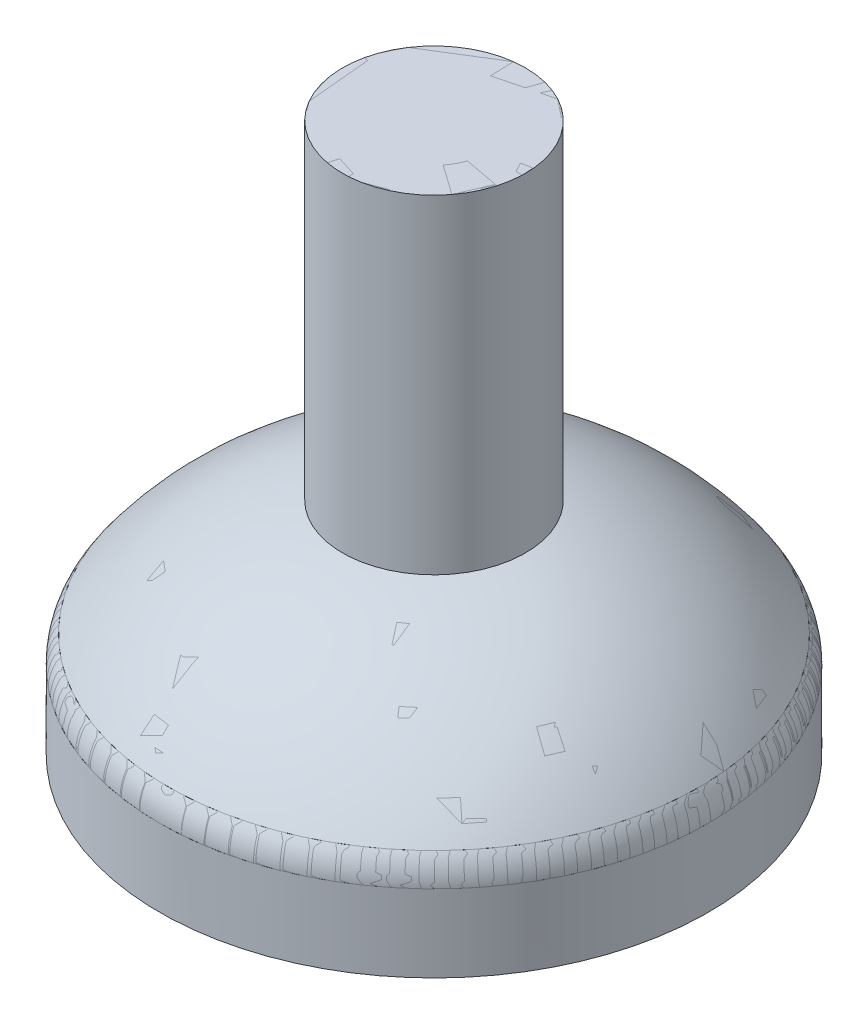
ISO-10303-21;
HEADER;
FILE_DESCRIPTION(('STEP AP214'),'2;1');
FILE_NAME('part.step','',(''),(''),'','','');
FILE_SCHEMA(('AUTOMOTIVE_DESIGN { 1 0 10303 214 1 1 1 1 }'));
ENDSEC;
DATA;
#1=APPLICATION_CONTEXT('core data for automotive mechanical design processes');
#2=APPLICATION_PROTOCOL_DEFINITION('international standard','automotive_design',2000,#1);
#3=PRODUCT_CONTEXT('',#1,'mechanical');
#4=PRODUCT('Part','Part','',(#3));
#5=PRODUCT_RELATED_PRODUCT_CATEGORY('part','',(#4));
#6=PRODUCT_DEFINITION_FORMATION('','',#4);
#7=PRODUCT_DEFINITION_CONTEXT('part definition',#1,'design');
#8=PRODUCT_DEFINITION('design','',#6,#7);
#9=PRODUCT_DEFINITION_SHAPE('','',#8);
#10=(LENGTH_UNIT() NAMED_UNIT(*) SI_UNIT(.MILLI.,.METRE.));
#11=(NAMED_UNIT(*) PLANE_ANGLE_UNIT() SI_UNIT($,.RADIAN.));
#12=(NAMED_UNIT(*) SI_UNIT($,.STERADIAN.) SOLID_ANGLE_UNIT());
#13=UNCERTAINTY_MEASURE_WITH_UNIT(LENGTH_MEASURE(1.E-05),#10,'distance_accuracy_value','');
#14=(GEOMETRIC_REPRESENTATION_CONTEXT(3) GLOBAL_UNCERTAINTY_ASSIGNED_CONTEXT((#13)) GLOBAL_UNIT_ASSIGNED_CONTEXT((#10,
#11,#12)) REPRESENTATION_CONTEXT('',''));
#15=CARTESIAN_POINT('',(0.,0.,0.));
#16=DIRECTION('',(0.,0.,1.));
#17=DIRECTION('',(1.,0.,0.));
#18=AXIS2_PLACEMENT_3D('',#15,#16,#17);
#19=CARTESIAN_POINT('',(-1.18800596857497E-13,50.,0.));
#20=DIRECTION('',(0.,-1.,0.));
#21=DIRECTION('',(1.,0.,0.));
#22=AXIS2_PLACEMENT_3D('',#19,#20,#21);
#23=PLANE('',#22);
#24=CARTESIAN_POINT('',(0.,50.,0.));
#25=DIRECTION('',(0.,-1.,0.));
#26=DIRECTION('',(1.,0.,0.));
#27=AXIS2_PLACEMENT_3D('',#24,#25,#26);
#28=CIRCLE('',#27,6.);
#29=CARTESIAN_POINT('',(6.,50.,0.));
#30=VERTEX_POINT('',#29);
#31=EDGE_CURVE('E13',#30,#30,#28,.F.);
#32=ORIENTED_EDGE('',*,*,#31,.T.);
#33=EDGE_LOOP('',(#32));
#34=FACE_BOUND('',#33,.T.);
#35=ADVANCED_FACE('F78',(#34),#23,.F.);
#36=OPEN_SHELL('',(#35));
#37=SHELL_BASED_SURFACE_MODEL('B2',(#36));
#38=CARTESIAN_POINT('',(0.,50.,0.));
#39=DIRECTION('',(0.,-1.,0.));
#40=DIRECTION('',(0.,0.,-1.));
#41=AXIS2_PLACEMENT_3D('',#38,#39,#40);
#42=PLANE('',#41);
#43=CARTESIAN_POINT('',(0.,50.,0.));
#44=DIRECTION('',(0.,-1.,0.));
#45=DIRECTION('',(0.,0.,-1.));
#46=AXIS2_PLACEMENT_3D('',#43,#44,#45);
#47=CIRCLE('',#46,10.);
#48=CARTESIAN_POINT('',(0.,50.,-10.));
#49=VERTEX_POINT('',#48);
#50=EDGE_CURVE('E77',#49,#49,#47,.T.);
#51=ORIENTED_EDGE('',*,*,#50,.F.);
#52=EDGE_LOOP('',(#51));
#53=FACE_BOUND('',#52,.T.);
#54=ADVANCED_FACE('F103',(#53),#42,.F.);
#55=OPEN_SHELL('',(#54));
#56=SHELL_BASED_SURFACE_MODEL('B8',(#55));
#57=CARTESIAN_POINT('',(0.644392351935432,-1.55929037654342,30.000000952671));
#58=DIRECTION('',(0.,-1.,0.));
#59=DIRECTION('',(-0.999999999998907,0.,-1.47840202791453E-06));
#60=AXIS2_PLACEMENT_3D('',#57,#58,#59);
#61=PLANE('',#60);
#62=CARTESIAN_POINT('',(0.,-1.55929037654342,30.));
#63=CARTESIAN_POINT('',(-0.644552371913862,-1.55929037654342,29.9999990470925));
#64=CARTESIAN_POINT('',(-3.16525432106434,-1.55929037654342,29.9202806916136));
#65=CARTESIAN_POINT('',(-8.26962113542297,-1.55929037654342,29.1125402238125));
#66=CARTESIAN_POINT('',(-16.1612420743914,-1.55929037654343,25.9215433021172));
#67=CARTESIAN_POINT('',(-23.436357526206,-1.55929037654342,19.6397738977112));
#68=CARTESIAN_POINT('',(-28.1437919198371,-1.55929037654343,11.4331736908759));
#69=CARTESIAN_POINT('',(-30.2566551255534,-1.55929037654343,3.05134129951869));
#70=CARTESIAN_POINT('',(-29.9503328345706,-1.55929037654342,-5.26449103840131));
#71=CARTESIAN_POINT('',(-27.0738834338733,-1.55929037654342,-13.9249991525626));
#72=CARTESIAN_POINT('',(-21.064689556289,-1.55929037654343,-22.3880854091475));
#73=CARTESIAN_POINT('',(-12.4162491087747,-1.55929037654342,-27.946398729217));
#74=CARTESIAN_POINT('',(-2.8193351851086,-1.55929037654343,-30.2478999684719));
#75=CARTESIAN_POINT('',(5.26450122217147,-1.55929037654343,-29.9503711705422));
#76=CARTESIAN_POINT('',(13.9249973641983,-1.55929037654342,-27.0738767017214));
#77=CARTESIAN_POINT('',(20.8459831056531,-1.55929037654342,-22.1596555580306));
#78=CARTESIAN_POINT('',(26.3503591142109,-1.55929037654342,-15.1161246635229));
#79=CARTESIAN_POINT('',(29.866128550795,-1.55929037654342,-6.54197230027541));
#80=CARTESIAN_POINT('',(30.353870436161,-1.55929037654342,2.74919510068262));
#81=CARTESIAN_POINT('',(27.9509479287229,-1.55929037654342,12.06740591218));
#82=CARTESIAN_POINT('',(22.8552900707096,-1.55929037654342,20.4034501179128));
#83=CARTESIAN_POINT('',(15.3128851703049,-1.55929037654342,26.3351601866233));
#84=CARTESIAN_POINT('',(7.90038592307573,-1.55929037654342,29.1708831651559));
#85=CARTESIAN_POINT('',(3.16473716708824,-1.55929037654342,29.9203001561334));
#86=CARTESIAN_POINT('',(0.644392351935432,-1.55929037654342,30.000000952671));
#87=CARTESIAN_POINT('',(0.,-1.55929037654342,30.));
#88=B_SPLINE_CURVE_WITH_KNOTS('',3,(#62,#63,#64,#65,#66,#67,#68,#69,#70,#71,#72,#73,#74,#75,#76,
#77,#78,#79,#80,#81,#82,#83,#84,#85,#86,#87),.UNSPECIFIED.,.T.,.F.,(4,1,1,1,1,1,1,1,1,1,1,1,1,1,
1,1,1,1,1,1,1,1,1,4),(0.,0.0102579911031687,0.0401157094266542,0.0818804187444345,
0.144562692401133,0.1902049550776,0.230919105134809,0.281005413815135,0.321028704089461,
0.374998336740974,0.443855714304826,0.480919105134809,0.531005413815135,0.571028704089461,
0.624998336740974,0.664181926764907,0.71224080695103,0.770793169980908,0.809798883491781,
0.864241702961095,0.924031285061479,0.959888038413167,0.989744555599918,1.),.UNSPECIFIED.);
#89=CARTESIAN_POINT('',(0.,-1.55929037654342,30.));
#90=VERTEX_POINT('',#89);
#91=EDGE_CURVE('E102',#90,#90,#88,.T.);
#92=ORIENTED_EDGE('',*,*,#91,.F.);
#93=EDGE_LOOP('',(#92));
#94=FACE_BOUND('',#93,.T.);
#95=CARTESIAN_POINT('',(2.95263956385676E-05,-1.55929037654342,9.99014801178763));
#96=CARTESIAN_POINT('',(-0.215051502689764,-1.55929037654343,9.99014762003898));
#97=CARTESIAN_POINT('',(-1.05546952946532,-1.55929037654343,9.98420524858686));
#98=CARTESIAN_POINT('',(-2.7585783411039,-1.55929037654342,9.7121560850228));
#99=CARTESIAN_POINT('',(-5.38594969823138,-1.55929037654343,8.63857531380397));
#100=CARTESIAN_POINT('',(-7.80942623489931,-1.55929037654342,6.54449866869036));
#101=CARTESIAN_POINT('',(-9.38428564382717,-1.55929037654343,3.81176937851403));
#102=CARTESIAN_POINT('',(-10.0883449477356,-1.55929037654343,1.01716937793569));
#103=CARTESIAN_POINT('',(-9.98592547867134,-1.55929037654342,-1.7549629900225));
#104=CARTESIAN_POINT('',(-9.025821004255,-1.55929037654342,-4.64178684207614));
#105=CARTESIAN_POINT('',(-7.01836773672822,-1.55929037654342,-7.45934313318599));
#106=CARTESIAN_POINT('',(-4.13912868661638,-1.55929037654342,-9.31731033884734));
#107=CARTESIAN_POINT('',(-0.93990237151419,-1.55929037654342,-10.0855263801625));
#108=CARTESIAN_POINT('',(1.75488713776625,-1.55929037654343,-9.98593042953104));
#109=CARTESIAN_POINT('',(4.64171581591682,-1.55929037654342,-9.02585914465808));
#110=CARTESIAN_POINT('',(6.94588391822176,-1.55929037654342,-7.38421053676711));
#111=CARTESIAN_POINT('',(8.78352199783138,-1.55929037654343,-5.03843830281855));
#112=CARTESIAN_POINT('',(9.95789788877089,-1.55929037654342,-2.18093423844639));
#113=CARTESIAN_POINT('',(10.1207374361067,-1.55929037654343,0.916345677603762));
#114=CARTESIAN_POINT('',(9.31972657213874,-1.55929037654343,4.02282561223756));
#115=CARTESIAN_POINT('',(7.61490460878052,-1.55929037654342,6.79769738799291));
#116=CARTESIAN_POINT('',(5.10408435353565,-1.55929037654342,8.77777176955977));
#117=CARTESIAN_POINT('',(2.63547568098967,-1.55929037654342,9.73119131024954));
#118=CARTESIAN_POINT('',(1.05539647256095,-1.55929037654342,9.98420467232548));
#119=CARTESIAN_POINT('',(0.215057158328011,-1.55929037654342,9.99014840343902));
#120=CARTESIAN_POINT('',(2.95263956385676E-05,-1.55929037654342,9.99014801178763));
#121=B_SPLINE_CURVE_WITH_KNOTS('',3,(#95,#96,#97,#98,#99,#100,#101,#102,#103,#104,#105,#106,
#107,#108,#109,#110,#111,#112,#113,#114,#115,#116,#117,#118,#119,#120),.UNSPECIFIED.,.T.,.F.,(4,
1,1,1,1,1,1,1,1,1,1,1,1,1,1,1,1,1,1,1,1,1,1,4),(0.,0.0102579911031687,0.0401157094266542,
0.0818804187444345,0.144562692401133,0.1902049550776,0.230919105134809,0.281005413815135,
0.321028704089461,0.374998336740974,0.443855714304826,0.480919105134809,0.531005413815135,
0.571028704089461,0.624998336740974,0.664181926764907,0.71224080695103,0.770793169980908,
0.809798883491781,0.864241702961095,0.924031285061479,0.959888038413167,0.989744555599918,1.),.UNSPECIFIED.);
#122=CARTESIAN_POINT('',(2.95263956385676E-05,-1.55929037654342,9.99014801178763));
#123=VERTEX_POINT('',#122);
#124=EDGE_CURVE('E129',#123,#123,#121,.F.);
#125=ORIENTED_EDGE('',*,*,#124,.F.);
#126=EDGE_LOOP('',(#125));
#127=FACE_BOUND('',#126,.T.);
#128=ADVANCED_FACE('F128',(#94,#127),#61,.F.);
#129=OPEN_SHELL('',(#128));
#130=SHELL_BASED_SURFACE_MODEL('B72',(#129));
#131=CARTESIAN_POINT('',(0.,1.39151240351967,0.));
#132=DIRECTION('',(0.,1.,0.));
#133=DIRECTION('',(0.,0.,1.));
#134=AXIS2_PLACEMENT_3D('',#131,#132,#133);
#135=PLANE('',#134);
#136=CARTESIAN_POINT('',(0.,1.39151240351967,0.));
#137=DIRECTION('',(0.,1.,0.));
#138=DIRECTION('',(0.,0.,1.));
#139=AXIS2_PLACEMENT_3D('',#136,#137,#138);
#140=CIRCLE('',#139,29.0364294807629);
#141=CARTESIAN_POINT('',(0.,1.39151240351967,29.0364294807629));
#142=VERTEX_POINT('',#141);
#143=EDGE_CURVE('E127',#142,#142,#140,.T.);
#144=ORIENTED_EDGE('',*,*,#143,.T.);
#145=EDGE_LOOP('',(#144));
#146=FACE_BOUND('',#145,.T.);
#147=ADVANCED_FACE('F171',(#146),#135,.T.);
#148=OPEN_SHELL('',(#147));
#149=SHELL_BASED_SURFACE_MODEL('B97',(#148));
#150=CARTESIAN_POINT('',(0.,9.17631656155722,0.));
#151=DIRECTION('',(0.,1.,0.));
#152=DIRECTION('',(0.,0.,1.));
#153=AXIS2_PLACEMENT_3D('',#150,#151,#152);
#154=PLANE('',#153);
#155=CARTESIAN_POINT('',(0.,9.17631656155722,0.));
#156=DIRECTION('',(0.,1.,0.));
#157=DIRECTION('',(0.,0.,1.));
#158=AXIS2_PLACEMENT_3D('',#155,#156,#157);
#159=CIRCLE('',#158,8.84343670463969);
#160=CARTESIAN_POINT('',(0.,9.17631656155722,8.84343670463969));
#161=VERTEX_POINT('',#160);
#162=EDGE_CURVE('E170',#161,#161,#159,.F.);
#163=ORIENTED_EDGE('',*,*,#162,.F.);
#164=EDGE_LOOP('',(#163));
#165=FACE_BOUND('',#164,.T.);
#166=ADVANCED_FACE('F196',(#165),#154,.T.);
#167=OPEN_SHELL('',(#166));
#168=SHELL_BASED_SURFACE_MODEL('B122',(#167));
#169=CARTESIAN_POINT('',(0.,-1.55929037654343,0.));
#170=DIRECTION('',(0.,1.,0.));
#171=DIRECTION('',(0.,0.,1.));
#172=AXIS2_PLACEMENT_3D('',#169,#170,#171);
#173=TOROIDAL_SURFACE('',#172,25.,5.);
#174=CARTESIAN_POINT('',(0.,1.39151240351967,0.));
#175=DIRECTION('',(0.,-1.,0.));
#176=DIRECTION('',(0.,0.,-1.));
#177=AXIS2_PLACEMENT_3D('',#174,#175,#176);
#178=CIRCLE('',#177,29.0364294807629);
#179=CARTESIAN_POINT('',(0.,1.39151240351967,-29.0364294807629));
#180=VERTEX_POINT('',#179);
#181=EDGE_CURVE('E224',#180,#180,#178,.F.);
#182=ORIENTED_EDGE('',*,*,#181,.F.);
#183=EDGE_LOOP('',(#182));
#184=FACE_BOUND('',#183,.T.);
#185=CARTESIAN_POINT('',(0.,-1.55929037654342,0.));
#186=DIRECTION('',(0.,1.,0.));
#187=DIRECTION('',(0.,0.,1.));
#188=AXIS2_PLACEMENT_3D('',#185,#186,#187);
#189=CIRCLE('',#188,30.);
#190=CARTESIAN_POINT('',(0.,-1.55929037654342,30.));
#191=VERTEX_POINT('',#190);
#192=EDGE_CURVE('E195',#191,#191,#189,.F.);
#193=ORIENTED_EDGE('',*,*,#192,.F.);
#194=EDGE_LOOP('',(#193));
#195=FACE_BOUND('',#194,.T.);
#196=ADVANCED_FACE('F220',(#184,#195),#173,.T.);
#197=OPEN_SHELL('',(#196));
#198=SHELL_BASED_SURFACE_MODEL('B165',(#197));
#199=CARTESIAN_POINT('',(0.,-18.1138206286321,0.));
#200=DIRECTION('',(0.,-1.,0.));
#201=DIRECTION('',(0.,0.,-1.));
#202=AXIS2_PLACEMENT_3D('',#199,#200,#201);
#203=DEGENERATE_TOROIDAL_SURFACE('',#202,2.35491019556269,33.0508923943312,.T.);
#204=CARTESIAN_POINT('',(0.,1.39151240351967,0.));
#205=DIRECTION('',(0.,-1.,0.));
#206=DIRECTION('',(0.,0.,-1.));
#207=AXIS2_PLACEMENT_3D('',#204,#205,#206);
#208=CIRCLE('',#207,29.0364294807629);
#209=CARTESIAN_POINT('',(0.,1.39151240351967,-29.0364294807629));
#210=VERTEX_POINT('',#209);
#211=EDGE_CURVE('E261',#210,#210,#208,.F.);
#212=ORIENTED_EDGE('',*,*,#211,.T.);
#213=EDGE_LOOP('',(#212));
#214=FACE_BOUND('',#213,.T.);
#215=CARTESIAN_POINT('',(0.,14.0407138874163,0.));
#216=DIRECTION('',(0.,-1.,0.));
#217=DIRECTION('',(0.,0.,-1.));
#218=AXIS2_PLACEMENT_3D('',#215,#216,#217);
#219=CIRCLE('',#218,10.);
#220=CARTESIAN_POINT('',(0.,14.0407138874163,-10.));
#221=VERTEX_POINT('',#220);
#222=EDGE_CURVE('E219',#221,#221,#219,.T.);
#223=ORIENTED_EDGE('',*,*,#222,.T.);
#224=EDGE_LOOP('',(#223));
#225=FACE_BOUND('',#224,.T.);
#226=ADVANCED_FACE('F257',(#214,#225),#203,.T.);
#227=OPEN_SHELL('',(#226));
#228=SHELL_BASED_SURFACE_MODEL('B190',(#227));
#229=CARTESIAN_POINT('',(0.,9.17631656155721,0.));
#230=DIRECTION('',(0.,1.,0.));
#231=DIRECTION('',(0.,0.,1.));
#232=AXIS2_PLACEMENT_3D('',#229,#230,#231);
#233=PLANE('',#232);
#234=CARTESIAN_POINT('',(0.,9.17631656155721,0.));
#235=DIRECTION('',(0.,1.,0.));
#236=DIRECTION('',(0.,0.,1.));
#237=AXIS2_PLACEMENT_3D('',#234,#235,#236);
#238=CIRCLE('',#237,6.);
#239=CARTESIAN_POINT('',(0.,9.17631656155721,6.));
#240=VERTEX_POINT('',#239);
#241=EDGE_CURVE('E330',#240,#240,#238,.F.);
#242=ORIENTED_EDGE('',*,*,#241,.F.);
#243=EDGE_LOOP('',(#242));
#244=FACE_BOUND('',#243,.T.);
#245=CARTESIAN_POINT('',(0.,9.17631656155721,0.));
#246=DIRECTION('',(0.,-1.,0.));
#247=DIRECTION('',(0.,0.,-1.));
#248=AXIS2_PLACEMENT_3D('',#245,#246,#247);
#249=CIRCLE('',#248,8.84343670463969);
#250=CARTESIAN_POINT('',(0.,9.17631656155721,-8.84343670463969));
#251=VERTEX_POINT('',#250);
#252=EDGE_CURVE('E303',#251,#251,#249,.T.);
#253=ORIENTED_EDGE('',*,*,#252,.T.);
#254=EDGE_LOOP('',(#253));
#255=FACE_BOUND('',#254,.T.);
#256=ADVANCED_FACE('F287',(#244,#255),#233,.F.);
#257=CARTESIAN_POINT('',(0.,-18.1138206286321,0.));
#258=DIRECTION('',(0.,-1.,0.));
#259=DIRECTION('',(0.,0.,-1.));
#260=AXIS2_PLACEMENT_3D('',#257,#258,#259);
#261=DEGENERATE_TOROIDAL_SURFACE('',#260,2.35491019556269,28.0508923943312,.T.);
#262=ORIENTED_EDGE('',*,*,#252,.F.);
#263=EDGE_LOOP('',(#262));
#264=FACE_BOUND('',#263,.T.);
#265=CARTESIAN_POINT('',(0.,-2.74029221548931,0.));
#266=DIRECTION('',(0.,-1.,0.));
#267=DIRECTION('',(0.,0.,-1.));
#268=AXIS2_PLACEMENT_3D('',#265,#266,#267);
#269=CIRCLE('',#268,25.8177997927253);
#270=CARTESIAN_POINT('',(0.,-2.74029221548931,-25.8177997927253));
#271=VERTEX_POINT('',#270);
#272=EDGE_CURVE('E310',#271,#271,#269,.T.);
#273=ORIENTED_EDGE('',*,*,#272,.T.);
#274=EDGE_LOOP('',(#273));
#275=FACE_BOUND('',#274,.T.);
#276=ADVANCED_FACE('F364',(#264,#275),#261,.F.);
#277=CARTESIAN_POINT('',(0.,14.0407138874163,0.));
#278=DIRECTION('',(0.,-1.,0.));
#279=DIRECTION('',(0.,0.,-1.));
#280=AXIS2_PLACEMENT_3D('',#277,#278,#279);
#281=CYLINDRICAL_SURFACE('',#280,25.8177997927253);
#282=ORIENTED_EDGE('',*,*,#272,.F.);
#283=EDGE_LOOP('',(#282));
#284=FACE_BOUND('',#283,.T.);
#285=CARTESIAN_POINT('',(0.,-9.99999999999999,0.));
#286=DIRECTION('',(0.,-1.,0.));
#287=DIRECTION('',(0.,0.,-1.));
#288=AXIS2_PLACEMENT_3D('',#285,#286,#287);
#289=CIRCLE('',#288,25.8177997927253);
#290=CARTESIAN_POINT('',(0.,-9.99999999999999,-25.8177997927253));
#291=VERTEX_POINT('',#290);
#292=EDGE_CURVE('E315',#291,#291,#289,.T.);
#293=ORIENTED_EDGE('',*,*,#292,.T.);
#294=EDGE_LOOP('',(#293));
#295=FACE_BOUND('',#294,.T.);
#296=ADVANCED_FACE('F370',(#284,#295),#281,.F.);
#297=CARTESIAN_POINT('',(-25.8177997927253,-9.99999999999999,0.));
#298=DIRECTION('',(0.,1.,0.));
#299=DIRECTION('',(0.,0.,1.));
#300=AXIS2_PLACEMENT_3D('',#297,#298,#299);
#301=PLANE('',#300);
#302=ORIENTED_EDGE('',*,*,#292,.F.);
#303=EDGE_LOOP('',(#302));
#304=FACE_BOUND('',#303,.T.);
#305=CARTESIAN_POINT('',(0.,-9.99999999999999,0.));
#306=DIRECTION('',(0.,-1.,0.));
#307=DIRECTION('',(0.,0.,-1.));
#308=AXIS2_PLACEMENT_3D('',#305,#306,#307);
#309=CIRCLE('',#308,30.);
#310=CARTESIAN_POINT('',(0.,-9.99999999999999,-30.));
#311=VERTEX_POINT('',#310);
#312=EDGE_CURVE('E319',#311,#311,#309,.T.);
#313=ORIENTED_EDGE('',*,*,#312,.T.);
#314=EDGE_LOOP('',(#313));
#315=FACE_BOUND('',#314,.T.);
#316=ADVANCED_FACE('F378',(#304,#315),#301,.F.);
#317=CARTESIAN_POINT('',(0.,14.0407138874163,0.));
#318=DIRECTION('',(0.,-1.,0.));
#319=DIRECTION('',(0.,0.,-1.));
#320=AXIS2_PLACEMENT_3D('',#317,#318,#319);
#321=CYLINDRICAL_SURFACE('',#320,30.);
#322=CARTESIAN_POINT('',(0.,-1.55929037654342,0.));
#323=DIRECTION('',(0.,1.,0.));
#324=DIRECTION('',(0.,0.,1.));
#325=AXIS2_PLACEMENT_3D('',#322,#323,#324);
#326=CIRCLE('',#325,30.);
#327=CARTESIAN_POINT('',(0.,-1.55929037654342,30.));
#328=VERTEX_POINT('',#327);
#329=EDGE_CURVE('E295',#328,#328,#326,.F.);
#330=ORIENTED_EDGE('',*,*,#329,.T.);
#331=EDGE_LOOP('',(#330));
#332=FACE_BOUND('',#331,.T.);
#333=ORIENTED_EDGE('',*,*,#312,.F.);
#334=EDGE_LOOP('',(#333));
#335=FACE_BOUND('',#334,.T.);
#336=ADVANCED_FACE('F360',(#332,#335),#321,.T.);
#337=CARTESIAN_POINT('',(0.,-18.1138206286321,0.));
#338=DIRECTION('',(0.,-1.,0.));
#339=DIRECTION('',(0.,0.,-1.));
#340=AXIS2_PLACEMENT_3D('',#337,#338,#339);
#341=DEGENERATE_TOROIDAL_SURFACE('',#340,2.35491019556269,33.0508923943312,.T.);
#342=CARTESIAN_POINT('',(0.,1.39151240351967,0.));
#343=DIRECTION('',(0.,-1.,0.));
#344=DIRECTION('',(0.,0.,-1.));
#345=AXIS2_PLACEMENT_3D('',#342,#343,#344);
#346=CIRCLE('',#345,29.0364294807629);
#347=CARTESIAN_POINT('',(0.,1.39151240351967,-29.0364294807629));
#348=VERTEX_POINT('',#347);
#349=EDGE_CURVE('E256',#348,#348,#346,.F.);
#350=ORIENTED_EDGE('',*,*,#349,.T.);
#351=EDGE_LOOP('',(#350));
#352=FACE_BOUND('',#351,.T.);
#353=CARTESIAN_POINT('',(0.,14.0407138874163,0.));
#354=DIRECTION('',(0.,-1.,0.));
#355=DIRECTION('',(0.,0.,-1.));
#356=AXIS2_PLACEMENT_3D('',#353,#354,#355);
#357=CIRCLE('',#356,10.);
#358=CARTESIAN_POINT('',(0.,14.0407138874163,-10.));
#359=VERTEX_POINT('',#358);
#360=EDGE_CURVE('E323',#359,#359,#357,.T.);
#361=ORIENTED_EDGE('',*,*,#360,.T.);
#362=EDGE_LOOP('',(#361));
#363=FACE_BOUND('',#362,.T.);
#364=ADVANCED_FACE('F352',(#352,#363),#341,.T.);
#365=CARTESIAN_POINT('',(0.,14.0407138874163,0.));
#366=DIRECTION('',(0.,-1.,0.));
#367=DIRECTION('',(0.,0.,-1.));
#368=AXIS2_PLACEMENT_3D('',#365,#366,#367);
#369=CYLINDRICAL_SURFACE('',#368,10.);
#370=ORIENTED_EDGE('',*,*,#360,.F.);
#371=EDGE_LOOP('',(#370));
#372=FACE_BOUND('',#371,.T.);
#373=CARTESIAN_POINT('',(0.,50.,0.));
#374=DIRECTION('',(0.,-1.,0.));
#375=DIRECTION('',(0.,0.,-1.));
#376=AXIS2_PLACEMENT_3D('',#373,#374,#375);
#377=CIRCLE('',#376,10.);
#378=CARTESIAN_POINT('',(0.,50.,-10.));
#379=VERTEX_POINT('',#378);
#380=EDGE_CURVE('E327',#379,#379,#377,.T.);
#381=ORIENTED_EDGE('',*,*,#380,.T.);
#382=EDGE_LOOP('',(#381));
#383=FACE_BOUND('',#382,.T.);
#384=ADVANCED_FACE('F347',(#372,#383),#369,.T.);
#385=CARTESIAN_POINT('',(-10.,50.,0.));
#386=DIRECTION('',(0.,-1.,0.));
#387=DIRECTION('',(0.,0.,-1.));
#388=AXIS2_PLACEMENT_3D('',#385,#386,#387);
#389=PLANE('',#388);
#390=CARTESIAN_POINT('',(0.,50.,0.));
#391=DIRECTION('',(0.,1.,0.));
#392=DIRECTION('',(0.,0.,1.));
#393=AXIS2_PLACEMENT_3D('',#390,#391,#392);
#394=CIRCLE('',#393,6.);
#395=CARTESIAN_POINT('',(0.,50.,6.));
#396=VERTEX_POINT('',#395);
#397=EDGE_CURVE('E334',#396,#396,#394,.T.);
#398=ORIENTED_EDGE('',*,*,#397,.F.);
#399=EDGE_LOOP('',(#398));
#400=FACE_BOUND('',#399,.T.);
#401=ORIENTED_EDGE('',*,*,#380,.F.);
#402=EDGE_LOOP('',(#401));
#403=FACE_BOUND('',#402,.T.);
#404=ADVANCED_FACE('F344',(#400,#403),#389,.F.);
#405=CARTESIAN_POINT('',(0.,50.,0.));
#406=DIRECTION('',(0.,-1.,0.));
#407=DIRECTION('',(0.,0.,-1.));
#408=AXIS2_PLACEMENT_3D('',#405,#406,#407);
#409=CYLINDRICAL_SURFACE('',#408,6.);
#410=ORIENTED_EDGE('',*,*,#397,.T.);
#411=EDGE_LOOP('',(#410));
#412=FACE_BOUND('',#411,.T.);
#413=ORIENTED_EDGE('',*,*,#241,.T.);
#414=EDGE_LOOP('',(#413));
#415=FACE_BOUND('',#414,.T.);
#416=ADVANCED_FACE('F341',(#412,#415),#409,.F.);
#417=CARTESIAN_POINT('',(0.,-1.55929037654343,0.));
#418=DIRECTION('',(0.,1.,0.));
#419=DIRECTION('',(0.,0.,1.));
#420=AXIS2_PLACEMENT_3D('',#417,#418,#419);
#421=TOROIDAL_SURFACE('',#420,25.,5.);
#422=ORIENTED_EDGE('',*,*,#349,.F.);
#423=EDGE_LOOP('',(#422));
#424=FACE_BOUND('',#423,.T.);
#425=ORIENTED_EDGE('',*,*,#329,.F.);
#426=EDGE_LOOP('',(#425));
#427=FACE_BOUND('',#426,.T.);
#428=ADVANCED_FACE('F289',(#424,#427),#421,.T.);
#429=CLOSED_SHELL('',(#256,#276,#296,#316,#336,#364,#384,#404,#416,#428));
#430=MANIFOLD_SOLID_BREP('B214',#429);
#431=ADVANCED_BREP_SHAPE_REPRESENTATION('',(#18,#430),#14);
#432=MANIFOLD_SURFACE_SHAPE_REPRESENTATION('',(#18,#37,#56,#130,#149,#168,#198,#228),#14);
#433=SHAPE_REPRESENTATION('',(#18),#14);
#434=SHAPE_DEFINITION_REPRESENTATION(#9,#433);
#435=SHAPE_REPRESENTATION_RELATIONSHIP('','',#433,#431);
#436=SHAPE_REPRESENTATION_RELATIONSHIP('','',#433,#432);
ENDSEC;
END-ISO-10303-21;
